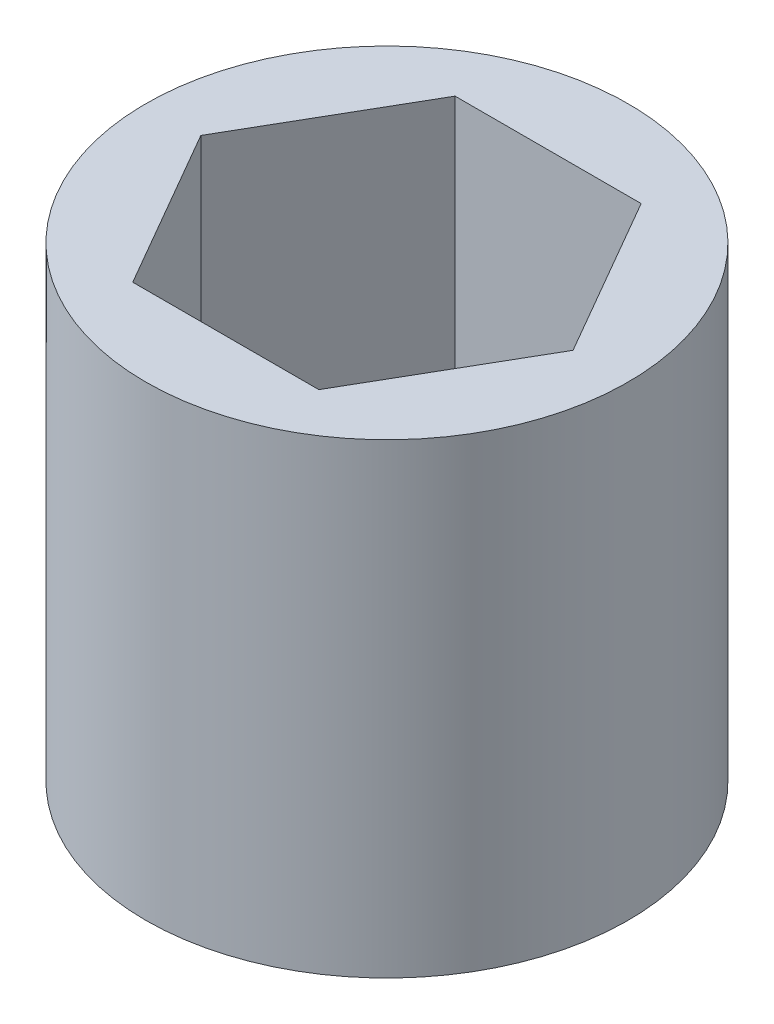
ISO-10303-21;
HEADER;
FILE_DESCRIPTION(('STEP AP214'),'2;1');
FILE_NAME('part.step','',(''),(''),'','','');
FILE_SCHEMA(('AUTOMOTIVE_DESIGN { 1 0 10303 214 1 1 1 1 }'));
ENDSEC;
DATA;
#1=APPLICATION_CONTEXT('core data for automotive mechanical design processes');
#2=APPLICATION_PROTOCOL_DEFINITION('international standard','automotive_design',2000,#1);
#3=PRODUCT_CONTEXT('',#1,'mechanical');
#4=PRODUCT('Part','Part','',(#3));
#5=PRODUCT_RELATED_PRODUCT_CATEGORY('part','',(#4));
#6=PRODUCT_DEFINITION_FORMATION('','',#4);
#7=PRODUCT_DEFINITION_CONTEXT('part definition',#1,'design');
#8=PRODUCT_DEFINITION('design','',#6,#7);
#9=PRODUCT_DEFINITION_SHAPE('','',#8);
#10=(LENGTH_UNIT() NAMED_UNIT(*) SI_UNIT(.MILLI.,.METRE.));
#11=(NAMED_UNIT(*) PLANE_ANGLE_UNIT() SI_UNIT($,.RADIAN.));
#12=(NAMED_UNIT(*) SI_UNIT($,.STERADIAN.) SOLID_ANGLE_UNIT());
#13=UNCERTAINTY_MEASURE_WITH_UNIT(LENGTH_MEASURE(1.E-05),#10,'distance_accuracy_value','');
#14=(GEOMETRIC_REPRESENTATION_CONTEXT(3) GLOBAL_UNCERTAINTY_ASSIGNED_CONTEXT((#13)) GLOBAL_UNIT_ASSIGNED_CONTEXT((#10,
#11,#12)) REPRESENTATION_CONTEXT('',''));
#15=CARTESIAN_POINT('',(0.,0.,0.));
#16=DIRECTION('',(0.,0.,1.));
#17=DIRECTION('',(1.,0.,0.));
#18=AXIS2_PLACEMENT_3D('',#15,#16,#17);
#19=CARTESIAN_POINT('',(0.,7.25,0.));
#20=DIRECTION('',(0.,1.,0.));
#21=DIRECTION('',(0.,0.,1.));
#22=AXIS2_PLACEMENT_3D('',#19,#20,#21);
#23=PLANE('',#22);
#24=CARTESIAN_POINT('',(0.,7.25,0.));
#25=DIRECTION('',(0.,1.,0.));
#26=DIRECTION('',(0.,0.,1.));
#27=AXIS2_PLACEMENT_3D('',#24,#25,#26);
#28=CIRCLE('',#27,7.5);
#29=CARTESIAN_POINT('',(0.,7.25,7.5));
#30=VERTEX_POINT('',#29);
#31=EDGE_CURVE('E11',#30,#30,#28,.T.);
#32=ORIENTED_EDGE('',*,*,#31,.T.);
#33=EDGE_LOOP('',(#32));
#34=FACE_BOUND('',#33,.T.);
#35=DIRECTION('',(1.,0.,0.));
#36=VECTOR('',#35,1.);
#37=CARTESIAN_POINT('',(-2.89396822431298,7.25,5.0125));
#38=LINE('',#37,#36);
#39=CARTESIAN_POINT('',(-2.89396822431298,7.25,5.0125));
#40=VERTEX_POINT('',#39);
#41=CARTESIAN_POINT('',(2.89396822431301,7.25,5.0125));
#42=VERTEX_POINT('',#41);
#43=EDGE_CURVE('E100',#40,#42,#38,.T.);
#44=ORIENTED_EDGE('',*,*,#43,.F.);
#45=DIRECTION('',(0.499999999999998,0.,0.86602540378444));
#46=VECTOR('',#45,1.);
#47=CARTESIAN_POINT('',(-5.78793644862597,7.25,0.));
#48=LINE('',#47,#46);
#49=CARTESIAN_POINT('',(-5.78793644862597,7.25,0.));
#50=VERTEX_POINT('',#49);
#51=EDGE_CURVE('E92',#50,#40,#48,.T.);
#52=ORIENTED_EDGE('',*,*,#51,.F.);
#53=DIRECTION('',(-0.499999999999998,0.,0.86602540378444));
#54=VECTOR('',#53,1.);
#55=CARTESIAN_POINT('',(-2.89396822431299,7.25,-5.0125));
#56=LINE('',#55,#54);
#57=CARTESIAN_POINT('',(-2.89396822431299,7.25,-5.0125));
#58=VERTEX_POINT('',#57);
#59=EDGE_CURVE('E120',#58,#50,#56,.T.);
#60=ORIENTED_EDGE('',*,*,#59,.F.);
#61=DIRECTION('',(-1.,0.,0.));
#62=VECTOR('',#61,1.);
#63=CARTESIAN_POINT('',(2.89396822431299,7.25,-5.0125));
#64=LINE('',#63,#62);
#65=CARTESIAN_POINT('',(2.89396822431299,7.25,-5.0125));
#66=VERTEX_POINT('',#65);
#67=EDGE_CURVE('E118',#66,#58,#64,.T.);
#68=ORIENTED_EDGE('',*,*,#67,.F.);
#69=DIRECTION('',(-0.499999999999998,0.,-0.86602540378444));
#70=VECTOR('',#69,1.);
#71=CARTESIAN_POINT('',(5.78793644862597,7.25,0.));
#72=LINE('',#71,#70);
#73=CARTESIAN_POINT('',(5.78793644862597,7.25,0.));
#74=VERTEX_POINT('',#73);
#75=EDGE_CURVE('E114',#74,#66,#72,.T.);
#76=ORIENTED_EDGE('',*,*,#75,.F.);
#77=DIRECTION('',(0.499999999999995,0.,-0.866025403784441));
#78=VECTOR('',#77,1.);
#79=CARTESIAN_POINT('',(2.89396822431301,7.25,5.0125));
#80=LINE('',#79,#78);
#81=EDGE_CURVE('E112',#42,#74,#80,.T.);
#82=ORIENTED_EDGE('',*,*,#81,.F.);
#83=EDGE_LOOP('',(#44,#52,#60,#68,#76,#82));
#84=FACE_BOUND('',#83,.T.);
#85=ADVANCED_FACE('F39',(#34,#84),#23,.T.);
#86=CARTESIAN_POINT('',(0.,-7.25,0.));
#87=DIRECTION('',(0.,1.,0.));
#88=DIRECTION('',(0.,0.,1.));
#89=AXIS2_PLACEMENT_3D('',#86,#87,#88);
#90=PLANE('',#89);
#91=CARTESIAN_POINT('',(0.,-7.25,0.));
#92=DIRECTION('',(0.,1.,0.));
#93=DIRECTION('',(0.,0.,1.));
#94=AXIS2_PLACEMENT_3D('',#91,#92,#93);
#95=CIRCLE('',#94,7.5);
#96=CARTESIAN_POINT('',(0.,-7.25,7.5));
#97=VERTEX_POINT('',#96);
#98=EDGE_CURVE('E43',#97,#97,#95,.T.);
#99=ORIENTED_EDGE('',*,*,#98,.F.);
#100=EDGE_LOOP('',(#99));
#101=FACE_BOUND('',#100,.T.);
#102=DIRECTION('',(0.499999999999998,0.,0.86602540378444));
#103=VECTOR('',#102,1.);
#104=CARTESIAN_POINT('',(-5.78793644862597,-7.25,0.));
#105=LINE('',#104,#103);
#106=CARTESIAN_POINT('',(-5.78793644862597,-7.25,0.));
#107=VERTEX_POINT('',#106);
#108=CARTESIAN_POINT('',(-2.89396822431298,-7.25,5.0125));
#109=VERTEX_POINT('',#108);
#110=EDGE_CURVE('E62',#107,#109,#105,.T.);
#111=ORIENTED_EDGE('',*,*,#110,.T.);
#112=DIRECTION('',(1.,0.,0.));
#113=VECTOR('',#112,1.);
#114=CARTESIAN_POINT('',(-2.89396822431298,-7.25,5.0125));
#115=LINE('',#114,#113);
#116=CARTESIAN_POINT('',(2.89396822431301,-7.25,5.0125));
#117=VERTEX_POINT('',#116);
#118=EDGE_CURVE('E107',#109,#117,#115,.T.);
#119=ORIENTED_EDGE('',*,*,#118,.T.);
#120=DIRECTION('',(0.499999999999995,0.,-0.866025403784441));
#121=VECTOR('',#120,1.);
#122=CARTESIAN_POINT('',(2.89396822431301,-7.25,5.0125));
#123=LINE('',#122,#121);
#124=CARTESIAN_POINT('',(5.78793644862597,-7.25,0.));
#125=VERTEX_POINT('',#124);
#126=EDGE_CURVE('E124',#117,#125,#123,.T.);
#127=ORIENTED_EDGE('',*,*,#126,.T.);
#128=DIRECTION('',(-0.499999999999998,0.,-0.86602540378444));
#129=VECTOR('',#128,1.);
#130=CARTESIAN_POINT('',(5.78793644862597,-7.25,0.));
#131=LINE('',#130,#129);
#132=CARTESIAN_POINT('',(2.89396822431299,-7.25,-5.0125));
#133=VERTEX_POINT('',#132);
#134=EDGE_CURVE('E127',#125,#133,#131,.T.);
#135=ORIENTED_EDGE('',*,*,#134,.T.);
#136=DIRECTION('',(-1.,0.,0.));
#137=VECTOR('',#136,1.);
#138=CARTESIAN_POINT('',(2.89396822431299,-7.25,-5.0125));
#139=LINE('',#138,#137);
#140=CARTESIAN_POINT('',(-2.89396822431299,-7.25,-5.0125));
#141=VERTEX_POINT('',#140);
#142=EDGE_CURVE('E130',#133,#141,#139,.T.);
#143=ORIENTED_EDGE('',*,*,#142,.T.);
#144=DIRECTION('',(-0.499999999999998,0.,0.86602540378444));
#145=VECTOR('',#144,1.);
#146=CARTESIAN_POINT('',(-2.89396822431299,-7.25,-5.0125));
#147=LINE('',#146,#145);
#148=EDGE_CURVE('E101',#141,#107,#147,.T.);
#149=ORIENTED_EDGE('',*,*,#148,.T.);
#150=EDGE_LOOP('',(#111,#119,#127,#135,#143,#149));
#151=FACE_BOUND('',#150,.T.);
#152=ADVANCED_FACE('F147',(#101,#151),#90,.F.);
#153=CARTESIAN_POINT('',(0.,7.25,0.));
#154=DIRECTION('',(0.,-1.,0.));
#155=DIRECTION('',(0.,0.,-1.));
#156=AXIS2_PLACEMENT_3D('',#153,#154,#155);
#157=CYLINDRICAL_SURFACE('',#156,7.5);
#158=ORIENTED_EDGE('',*,*,#31,.F.);
#159=EDGE_LOOP('',(#158));
#160=FACE_BOUND('',#159,.T.);
#161=ORIENTED_EDGE('',*,*,#98,.T.);
#162=EDGE_LOOP('',(#161));
#163=FACE_BOUND('',#162,.T.);
#164=ADVANCED_FACE('F41',(#160,#163),#157,.T.);
#165=CARTESIAN_POINT('',(-5.78793644862597,7.25,0.));
#166=DIRECTION('',(0.86602540378444,0.,-0.499999999999998));
#167=DIRECTION('',(-0.499999999999998,0.,-0.86602540378444));
#168=AXIS2_PLACEMENT_3D('',#165,#166,#167);
#169=PLANE('',#168);
#170=ORIENTED_EDGE('',*,*,#110,.F.);
#171=DIRECTION('',(0.,-1.,0.));
#172=VECTOR('',#171,1.);
#173=CARTESIAN_POINT('',(-5.78793644862597,7.25,0.));
#174=LINE('',#173,#172);
#175=EDGE_CURVE('E96',#50,#107,#174,.T.);
#176=ORIENTED_EDGE('',*,*,#175,.F.);
#177=ORIENTED_EDGE('',*,*,#51,.T.);
#178=DIRECTION('',(0.,-1.,0.));
#179=VECTOR('',#178,1.);
#180=CARTESIAN_POINT('',(-2.89396822431298,7.25,5.0125));
#181=LINE('',#180,#179);
#182=EDGE_CURVE('E95',#40,#109,#181,.T.);
#183=ORIENTED_EDGE('',*,*,#182,.T.);
#184=EDGE_LOOP('',(#170,#176,#177,#183));
#185=FACE_BOUND('',#184,.T.);
#186=ADVANCED_FACE('F94',(#185),#169,.T.);
#187=CARTESIAN_POINT('',(-2.89396822431298,7.25,5.0125));
#188=DIRECTION('',(0.,0.,-1.));
#189=DIRECTION('',(-1.,0.,0.));
#190=AXIS2_PLACEMENT_3D('',#187,#188,#189);
#191=PLANE('',#190);
#192=ORIENTED_EDGE('',*,*,#118,.F.);
#193=ORIENTED_EDGE('',*,*,#182,.F.);
#194=ORIENTED_EDGE('',*,*,#43,.T.);
#195=DIRECTION('',(0.,-1.,0.));
#196=VECTOR('',#195,1.);
#197=CARTESIAN_POINT('',(2.89396822431301,7.25,5.0125));
#198=LINE('',#197,#196);
#199=EDGE_CURVE('E108',#42,#117,#198,.T.);
#200=ORIENTED_EDGE('',*,*,#199,.T.);
#201=EDGE_LOOP('',(#192,#193,#194,#200));
#202=FACE_BOUND('',#201,.T.);
#203=ADVANCED_FACE('F104',(#202),#191,.T.);
#204=CARTESIAN_POINT('',(2.89396822431301,7.25,5.0125));
#205=DIRECTION('',(-0.866025403784441,0.,-0.499999999999995));
#206=DIRECTION('',(-0.499999999999995,0.,0.866025403784441));
#207=AXIS2_PLACEMENT_3D('',#204,#205,#206);
#208=PLANE('',#207);
#209=ORIENTED_EDGE('',*,*,#126,.F.);
#210=ORIENTED_EDGE('',*,*,#199,.F.);
#211=ORIENTED_EDGE('',*,*,#81,.T.);
#212=DIRECTION('',(0.,-1.,0.));
#213=VECTOR('',#212,1.);
#214=CARTESIAN_POINT('',(5.78793644862597,7.25,0.));
#215=LINE('',#214,#213);
#216=EDGE_CURVE('E139',#74,#125,#215,.T.);
#217=ORIENTED_EDGE('',*,*,#216,.T.);
#218=EDGE_LOOP('',(#209,#210,#211,#217));
#219=FACE_BOUND('',#218,.T.);
#220=ADVANCED_FACE('F143',(#219),#208,.T.);
#221=CARTESIAN_POINT('',(5.78793644862597,7.25,0.));
#222=DIRECTION('',(-0.86602540378444,0.,0.499999999999998));
#223=DIRECTION('',(0.499999999999998,0.,0.86602540378444));
#224=AXIS2_PLACEMENT_3D('',#221,#222,#223);
#225=PLANE('',#224);
#226=ORIENTED_EDGE('',*,*,#134,.F.);
#227=ORIENTED_EDGE('',*,*,#216,.F.);
#228=ORIENTED_EDGE('',*,*,#75,.T.);
#229=DIRECTION('',(0.,-1.,0.));
#230=VECTOR('',#229,1.);
#231=CARTESIAN_POINT('',(2.89396822431299,7.25,-5.0125));
#232=LINE('',#231,#230);
#233=EDGE_CURVE('E137',#66,#133,#232,.T.);
#234=ORIENTED_EDGE('',*,*,#233,.T.);
#235=EDGE_LOOP('',(#226,#227,#228,#234));
#236=FACE_BOUND('',#235,.T.);
#237=ADVANCED_FACE('F155',(#236),#225,.T.);
#238=CARTESIAN_POINT('',(2.89396822431299,7.25,-5.0125));
#239=DIRECTION('',(0.,0.,1.));
#240=DIRECTION('',(1.,0.,0.));
#241=AXIS2_PLACEMENT_3D('',#238,#239,#240);
#242=PLANE('',#241);
#243=ORIENTED_EDGE('',*,*,#142,.F.);
#244=ORIENTED_EDGE('',*,*,#233,.F.);
#245=ORIENTED_EDGE('',*,*,#67,.T.);
#246=DIRECTION('',(0.,-1.,0.));
#247=VECTOR('',#246,1.);
#248=CARTESIAN_POINT('',(-2.89396822431299,7.25,-5.0125));
#249=LINE('',#248,#247);
#250=EDGE_CURVE('E54',#58,#141,#249,.T.);
#251=ORIENTED_EDGE('',*,*,#250,.T.);
#252=EDGE_LOOP('',(#243,#244,#245,#251));
#253=FACE_BOUND('',#252,.T.);
#254=ADVANCED_FACE('F153',(#253),#242,.T.);
#255=CARTESIAN_POINT('',(-2.89396822431299,7.25,-5.0125));
#256=DIRECTION('',(0.86602540378444,0.,0.499999999999998));
#257=DIRECTION('',(0.499999999999998,0.,-0.86602540378444));
#258=AXIS2_PLACEMENT_3D('',#255,#256,#257);
#259=PLANE('',#258);
#260=ORIENTED_EDGE('',*,*,#148,.F.);
#261=ORIENTED_EDGE('',*,*,#250,.F.);
#262=ORIENTED_EDGE('',*,*,#59,.T.);
#263=ORIENTED_EDGE('',*,*,#175,.T.);
#264=EDGE_LOOP('',(#260,#261,#262,#263));
#265=FACE_BOUND('',#264,.T.);
#266=ADVANCED_FACE('F149',(#265),#259,.T.);
#267=CLOSED_SHELL('',(#85,#152,#164,#186,#203,#220,#237,#254,#266));
#268=MANIFOLD_SOLID_BREP('B2',#267);
#269=ADVANCED_BREP_SHAPE_REPRESENTATION('',(#18,#268),#14);
#270=SHAPE_DEFINITION_REPRESENTATION(#9,#269);
ENDSEC;
END-ISO-10303-21;
